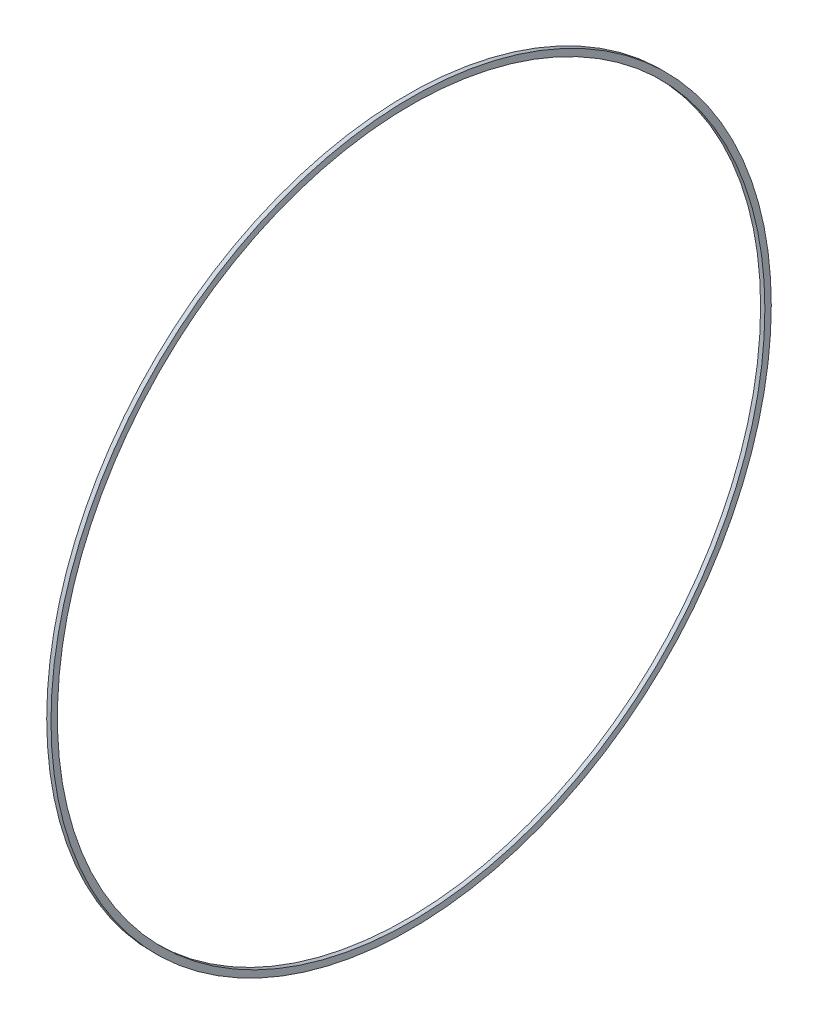
ISO-10303-21;
HEADER;
FILE_DESCRIPTION(('STEP AP214'),'2;1');
FILE_NAME('part.step','',(''),(''),'','','');
FILE_SCHEMA(('AUTOMOTIVE_DESIGN { 1 0 10303 214 1 1 1 1 }'));
ENDSEC;
DATA;
#1=APPLICATION_CONTEXT('core data for automotive mechanical design processes');
#2=APPLICATION_PROTOCOL_DEFINITION('international standard','automotive_design',2000,#1);
#3=PRODUCT_CONTEXT('',#1,'mechanical');
#4=PRODUCT('Part','Part','',(#3));
#5=PRODUCT_RELATED_PRODUCT_CATEGORY('part','',(#4));
#6=PRODUCT_DEFINITION_FORMATION('','',#4);
#7=PRODUCT_DEFINITION_CONTEXT('part definition',#1,'design');
#8=PRODUCT_DEFINITION('design','',#6,#7);
#9=PRODUCT_DEFINITION_SHAPE('','',#8);
#10=(LENGTH_UNIT() NAMED_UNIT(*) SI_UNIT(.MILLI.,.METRE.));
#11=(NAMED_UNIT(*) PLANE_ANGLE_UNIT() SI_UNIT($,.RADIAN.));
#12=(NAMED_UNIT(*) SI_UNIT($,.STERADIAN.) SOLID_ANGLE_UNIT());
#13=UNCERTAINTY_MEASURE_WITH_UNIT(LENGTH_MEASURE(1.E-05),#10,'distance_accuracy_value','');
#14=(GEOMETRIC_REPRESENTATION_CONTEXT(3) GLOBAL_UNCERTAINTY_ASSIGNED_CONTEXT((#13)) GLOBAL_UNIT_ASSIGNED_CONTEXT((#10,
#11,#12)) REPRESENTATION_CONTEXT('',''));
#15=CARTESIAN_POINT('',(0.,0.,0.));
#16=DIRECTION('',(0.,0.,1.));
#17=DIRECTION('',(1.,0.,0.));
#18=AXIS2_PLACEMENT_3D('',#15,#16,#17);
#19=CARTESIAN_POINT('',(2.,0.,0.));
#20=DIRECTION('',(1.,0.,0.));
#21=DIRECTION('',(0.,0.,-1.));
#22=AXIS2_PLACEMENT_3D('',#19,#20,#21);
#23=PLANE('',#22);
#24=CARTESIAN_POINT('',(2.,0.,0.));
#25=DIRECTION('',(1.,0.,0.));
#26=DIRECTION('',(0.,0.,-1.));
#27=AXIS2_PLACEMENT_3D('',#24,#25,#26);
#28=CIRCLE('',#27,168.5);
#29=CARTESIAN_POINT('',(2.,0.,-168.5));
#30=VERTEX_POINT('',#29);
#31=EDGE_CURVE('E10',#30,#30,#28,.T.);
#32=ORIENTED_EDGE('',*,*,#31,.T.);
#33=EDGE_LOOP('',(#32));
#34=FACE_BOUND('',#33,.T.);
#35=CARTESIAN_POINT('',(2.,0.,0.));
#36=DIRECTION('',(1.,0.,0.));
#37=DIRECTION('',(0.,0.,-1.));
#38=AXIS2_PLACEMENT_3D('',#35,#36,#37);
#39=CIRCLE('',#38,165.5);
#40=CARTESIAN_POINT('',(2.,0.,-165.5));
#41=VERTEX_POINT('',#40);
#42=EDGE_CURVE('E50',#41,#41,#39,.T.);
#43=ORIENTED_EDGE('',*,*,#42,.F.);
#44=EDGE_LOOP('',(#43));
#45=FACE_BOUND('',#44,.T.);
#46=ADVANCED_FACE('F37',(#34,#45),#23,.T.);
#47=CARTESIAN_POINT('',(0.,0.,0.));
#48=DIRECTION('',(1.,0.,0.));
#49=DIRECTION('',(0.,0.,-1.));
#50=AXIS2_PLACEMENT_3D('',#47,#48,#49);
#51=PLANE('',#50);
#52=CARTESIAN_POINT('',(0.,0.,0.));
#53=DIRECTION('',(1.,0.,0.));
#54=DIRECTION('',(0.,0.,-1.));
#55=AXIS2_PLACEMENT_3D('',#52,#53,#54);
#56=CIRCLE('',#55,168.5);
#57=CARTESIAN_POINT('',(0.,0.,-168.5));
#58=VERTEX_POINT('',#57);
#59=EDGE_CURVE('E41',#58,#58,#56,.T.);
#60=ORIENTED_EDGE('',*,*,#59,.F.);
#61=EDGE_LOOP('',(#60));
#62=FACE_BOUND('',#61,.T.);
#63=CARTESIAN_POINT('',(0.,0.,0.));
#64=DIRECTION('',(1.,0.,0.));
#65=DIRECTION('',(0.,0.,-1.));
#66=AXIS2_PLACEMENT_3D('',#63,#64,#65);
#67=CIRCLE('',#66,165.5);
#68=CARTESIAN_POINT('',(0.,0.,-165.5));
#69=VERTEX_POINT('',#68);
#70=EDGE_CURVE('E52',#69,#69,#67,.T.);
#71=ORIENTED_EDGE('',*,*,#70,.T.);
#72=EDGE_LOOP('',(#71));
#73=FACE_BOUND('',#72,.T.);
#74=ADVANCED_FACE('F64',(#62,#73),#51,.F.);
#75=CARTESIAN_POINT('',(2.,0.,0.));
#76=DIRECTION('',(-1.,0.,0.));
#77=DIRECTION('',(0.,0.,1.));
#78=AXIS2_PLACEMENT_3D('',#75,#76,#77);
#79=CYLINDRICAL_SURFACE('',#78,168.5);
#80=ORIENTED_EDGE('',*,*,#31,.F.);
#81=EDGE_LOOP('',(#80));
#82=FACE_BOUND('',#81,.T.);
#83=ORIENTED_EDGE('',*,*,#59,.T.);
#84=EDGE_LOOP('',(#83));
#85=FACE_BOUND('',#84,.T.);
#86=ADVANCED_FACE('F39',(#82,#85),#79,.T.);
#87=CARTESIAN_POINT('',(2.,0.,0.));
#88=DIRECTION('',(-1.,0.,0.));
#89=DIRECTION('',(0.,0.,1.));
#90=AXIS2_PLACEMENT_3D('',#87,#88,#89);
#91=CYLINDRICAL_SURFACE('',#90,165.5);
#92=ORIENTED_EDGE('',*,*,#42,.T.);
#93=EDGE_LOOP('',(#92));
#94=FACE_BOUND('',#93,.T.);
#95=ORIENTED_EDGE('',*,*,#70,.F.);
#96=EDGE_LOOP('',(#95));
#97=FACE_BOUND('',#96,.T.);
#98=ADVANCED_FACE('F60',(#94,#97),#91,.F.);
#99=CLOSED_SHELL('',(#46,#74,#86,#98));
#100=MANIFOLD_SOLID_BREP('B2',#99);
#101=ADVANCED_BREP_SHAPE_REPRESENTATION('',(#18,#100),#14);
#102=SHAPE_DEFINITION_REPRESENTATION(#9,#101);
ENDSEC;
END-ISO-10303-21;
